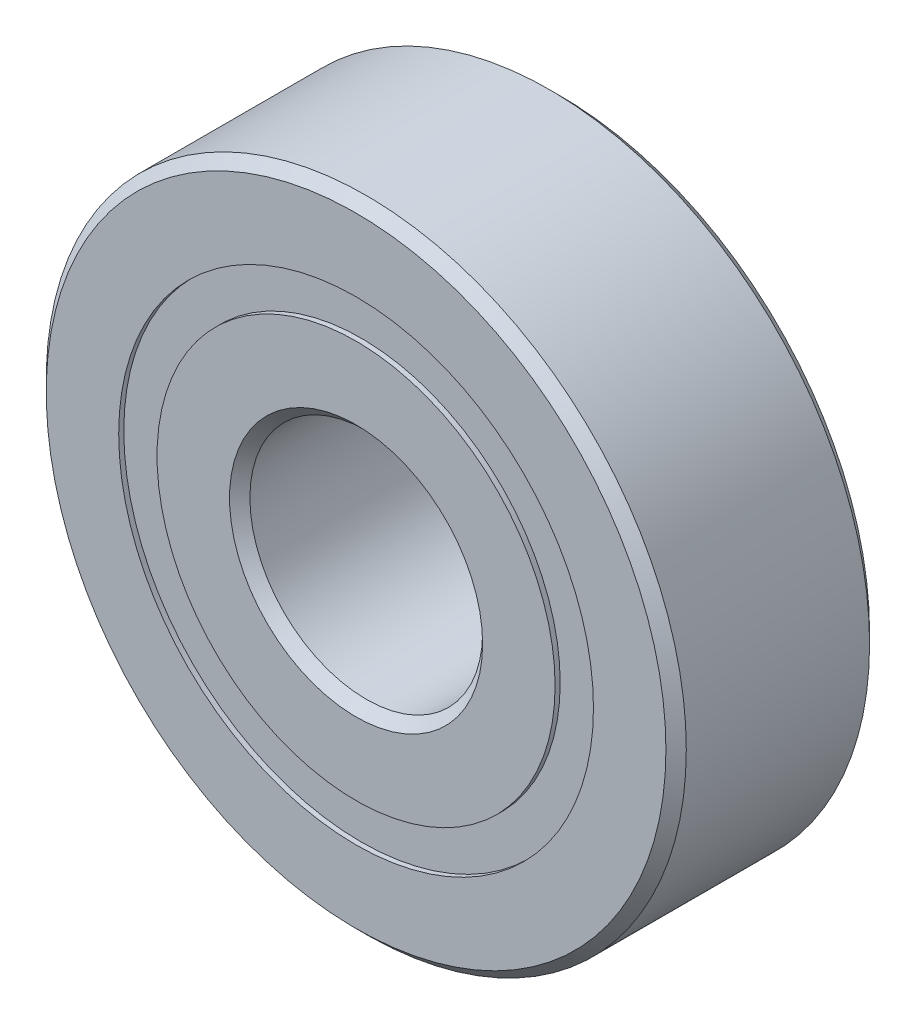
ISO-10303-21;
HEADER;
FILE_DESCRIPTION(('STEP AP214'),'2;1');
FILE_NAME('part.step','',(''),(''),'','','');
FILE_SCHEMA(('AUTOMOTIVE_DESIGN { 1 0 10303 214 1 1 1 1 }'));
ENDSEC;
DATA;
#1=APPLICATION_CONTEXT('core data for automotive mechanical design processes');
#2=APPLICATION_PROTOCOL_DEFINITION('international standard','automotive_design',2000,#1);
#3=PRODUCT_CONTEXT('',#1,'mechanical');
#4=PRODUCT('Part','Part','',(#3));
#5=PRODUCT_RELATED_PRODUCT_CATEGORY('part','',(#4));
#6=PRODUCT_DEFINITION_FORMATION('','',#4);
#7=PRODUCT_DEFINITION_CONTEXT('part definition',#1,'design');
#8=PRODUCT_DEFINITION('design','',#6,#7);
#9=PRODUCT_DEFINITION_SHAPE('','',#8);
#10=(LENGTH_UNIT() NAMED_UNIT(*) SI_UNIT(.MILLI.,.METRE.));
#11=(NAMED_UNIT(*) PLANE_ANGLE_UNIT() SI_UNIT($,.RADIAN.));
#12=(NAMED_UNIT(*) SI_UNIT($,.STERADIAN.) SOLID_ANGLE_UNIT());
#13=UNCERTAINTY_MEASURE_WITH_UNIT(LENGTH_MEASURE(1.E-05),#10,'distance_accuracy_value','');
#14=(GEOMETRIC_REPRESENTATION_CONTEXT(3) GLOBAL_UNCERTAINTY_ASSIGNED_CONTEXT((#13)) GLOBAL_UNIT_ASSIGNED_CONTEXT((#10,
#11,#12)) REPRESENTATION_CONTEXT('',''));
#15=CARTESIAN_POINT('',(0.,0.,0.));
#16=DIRECTION('',(0.,0.,1.));
#17=DIRECTION('',(1.,0.,0.));
#18=AXIS2_PLACEMENT_3D('',#15,#16,#17);
#19=CARTESIAN_POINT('',(-3.74999999999992,6.49519052838334,0.));
#20=DIRECTION('',(0.,0.,1.));
#21=DIRECTION('',(-0.499999999999989,0.866025403784445,0.));
#22=AXIS2_PLACEMENT_3D('',#19,#20,#21);
#23=SPHERICAL_SURFACE('',#22,1.68952158656808);
#24=CARTESIAN_POINT('',(-3.74999999999992,6.49519052838334,1.68952158656808));
#25=VERTEX_POINT('',#24);
#26=VERTEX_LOOP('',#25);
#27=FACE_BOUND('',#26,.T.);
#28=ADVANCED_FACE('F37',(#27),#23,.T.);
#29=CLOSED_SHELL('',(#28));
#30=MANIFOLD_SOLID_BREP('B2',#29);
#31=CARTESIAN_POINT('',(-6.49519052838325,3.75000000000008,0.));
#32=DIRECTION('',(0.,0.,1.));
#33=DIRECTION('',(-0.866025403784433,0.50000000000001,0.));
#34=AXIS2_PLACEMENT_3D('',#31,#32,#33);
#35=SPHERICAL_SURFACE('',#34,1.68952158656808);
#36=CARTESIAN_POINT('',(-6.49519052838325,3.75000000000008,1.68952158656808));
#37=VERTEX_POINT('',#36);
#38=VERTEX_LOOP('',#37);
#39=FACE_BOUND('',#38,.T.);
#40=ADVANCED_FACE('F57',(#39),#35,.T.);
#41=CLOSED_SHELL('',(#40));
#42=MANIFOLD_SOLID_BREP('B6',#41);
#43=CARTESIAN_POINT('',(-7.50000000000001,0.,0.));
#44=DIRECTION('',(0.,0.,1.));
#45=DIRECTION('',(-1.,0.,0.));
#46=AXIS2_PLACEMENT_3D('',#43,#44,#45);
#47=SPHERICAL_SURFACE('',#46,1.68952158656808);
#48=CARTESIAN_POINT('',(-7.50000000000001,0.,1.68952158656808));
#49=VERTEX_POINT('',#48);
#50=VERTEX_LOOP('',#49);
#51=FACE_BOUND('',#50,.T.);
#52=ADVANCED_FACE('F77',(#51),#47,.T.);
#53=CLOSED_SHELL('',(#52));
#54=MANIFOLD_SOLID_BREP('B33',#53);
#55=CARTESIAN_POINT('',(-6.49519052838333,-3.74999999999994,0.));
#56=DIRECTION('',(0.,0.,1.));
#57=DIRECTION('',(-0.866025403784443,-0.499999999999992,0.));
#58=AXIS2_PLACEMENT_3D('',#55,#56,#57);
#59=SPHERICAL_SURFACE('',#58,1.68952158656808);
#60=CARTESIAN_POINT('',(-6.49519052838333,-3.74999999999994,1.68952158656808));
#61=VERTEX_POINT('',#60);
#62=VERTEX_LOOP('',#61);
#63=FACE_BOUND('',#62,.T.);
#64=ADVANCED_FACE('F97',(#63),#59,.T.);
#65=CLOSED_SHELL('',(#64));
#66=MANIFOLD_SOLID_BREP('B53',#65);
#67=CARTESIAN_POINT('',(-3.75000000000006,-6.49519052838327,0.));
#68=DIRECTION('',(0.,0.,1.));
#69=DIRECTION('',(-0.500000000000007,-0.866025403784435,0.));
#70=AXIS2_PLACEMENT_3D('',#67,#68,#69);
#71=SPHERICAL_SURFACE('',#70,1.68952158656808);
#72=CARTESIAN_POINT('',(-3.75000000000006,-6.49519052838327,1.68952158656808));
#73=VERTEX_POINT('',#72);
#74=VERTEX_LOOP('',#73);
#75=FACE_BOUND('',#74,.T.);
#76=ADVANCED_FACE('F117',(#75),#71,.T.);
#77=CLOSED_SHELL('',(#76));
#78=MANIFOLD_SOLID_BREP('B73',#77);
#79=CARTESIAN_POINT('',(0.,-7.50000000000001,0.));
#80=DIRECTION('',(0.,0.,1.));
#81=DIRECTION('',(0.,-1.,0.));
#82=AXIS2_PLACEMENT_3D('',#79,#80,#81);
#83=SPHERICAL_SURFACE('',#82,1.68952158656808);
#84=CARTESIAN_POINT('',(0.,-7.50000000000001,1.68952158656808));
#85=VERTEX_POINT('',#84);
#86=VERTEX_LOOP('',#85);
#87=FACE_BOUND('',#86,.T.);
#88=ADVANCED_FACE('F137',(#87),#83,.T.);
#89=CLOSED_SHELL('',(#88));
#90=MANIFOLD_SOLID_BREP('B93',#89);
#91=CARTESIAN_POINT('',(3.74999999999997,-6.49519052838332,0.));
#92=DIRECTION('',(0.,0.,1.));
#93=DIRECTION('',(0.499999999999995,-0.866025403784442,0.));
#94=AXIS2_PLACEMENT_3D('',#91,#92,#93);
#95=SPHERICAL_SURFACE('',#94,1.68952158656808);
#96=CARTESIAN_POINT('',(3.74999999999997,-6.49519052838332,1.68952158656808));
#97=VERTEX_POINT('',#96);
#98=VERTEX_LOOP('',#97);
#99=FACE_BOUND('',#98,.T.);
#100=ADVANCED_FACE('F157',(#99),#95,.T.);
#101=CLOSED_SHELL('',(#100));
#102=MANIFOLD_SOLID_BREP('B113',#101);
#103=CARTESIAN_POINT('',(6.49519052838328,-3.75000000000003,0.));
#104=DIRECTION('',(0.,0.,1.));
#105=DIRECTION('',(0.866025403784436,-0.500000000000004,0.));
#106=AXIS2_PLACEMENT_3D('',#103,#104,#105);
#107=SPHERICAL_SURFACE('',#106,1.68952158656808);
#108=CARTESIAN_POINT('',(6.49519052838328,-3.75000000000003,1.68952158656808));
#109=VERTEX_POINT('',#108);
#110=VERTEX_LOOP('',#109);
#111=FACE_BOUND('',#110,.T.);
#112=ADVANCED_FACE('F177',(#111),#107,.T.);
#113=CLOSED_SHELL('',(#112));
#114=MANIFOLD_SOLID_BREP('B133',#113);
#115=CARTESIAN_POINT('',(7.50000000000001,0.,0.));
#116=DIRECTION('',(0.,0.,1.));
#117=DIRECTION('',(1.,0.,0.));
#118=AXIS2_PLACEMENT_3D('',#115,#116,#117);
#119=SPHERICAL_SURFACE('',#118,1.68952158656808);
#120=CARTESIAN_POINT('',(7.50000000000001,0.,1.68952158656808));
#121=VERTEX_POINT('',#120);
#122=VERTEX_LOOP('',#121);
#123=FACE_BOUND('',#122,.T.);
#124=ADVANCED_FACE('F197',(#123),#119,.T.);
#125=CLOSED_SHELL('',(#124));
#126=MANIFOLD_SOLID_BREP('B153',#125);
#127=CARTESIAN_POINT('',(6.4951905283833,3.74999999999999,0.));
#128=DIRECTION('',(0.,0.,1.));
#129=DIRECTION('',(0.86602540378444,0.499999999999998,0.));
#130=AXIS2_PLACEMENT_3D('',#127,#128,#129);
#131=SPHERICAL_SURFACE('',#130,1.68952158656808);
#132=CARTESIAN_POINT('',(6.4951905283833,3.74999999999999,1.68952158656808));
#133=VERTEX_POINT('',#132);
#134=VERTEX_LOOP('',#133);
#135=FACE_BOUND('',#134,.T.);
#136=ADVANCED_FACE('F217',(#135),#131,.T.);
#137=CLOSED_SHELL('',(#136));
#138=MANIFOLD_SOLID_BREP('B173',#137);
#139=CARTESIAN_POINT('',(3.75000000000001,6.49519052838329,0.));
#140=DIRECTION('',(0.,0.,1.));
#141=DIRECTION('',(0.500000000000001,0.866025403784438,0.));
#142=AXIS2_PLACEMENT_3D('',#139,#140,#141);
#143=SPHERICAL_SURFACE('',#142,1.68952158656808);
#144=CARTESIAN_POINT('',(3.75000000000001,6.49519052838329,1.68952158656808));
#145=VERTEX_POINT('',#144);
#146=VERTEX_LOOP('',#145);
#147=FACE_BOUND('',#146,.T.);
#148=ADVANCED_FACE('F237',(#147),#143,.T.);
#149=CLOSED_SHELL('',(#148));
#150=MANIFOLD_SOLID_BREP('B193',#149);
#151=CARTESIAN_POINT('',(0.,7.50000000000001,0.));
#152=DIRECTION('',(0.,0.,1.));
#153=DIRECTION('',(0.,1.,0.));
#154=AXIS2_PLACEMENT_3D('',#151,#152,#153);
#155=SPHERICAL_SURFACE('',#154,1.68952158656808);
#156=CARTESIAN_POINT('',(0.,7.50000000000001,1.68952158656808));
#157=VERTEX_POINT('',#156);
#158=VERTEX_LOOP('',#157);
#159=FACE_BOUND('',#158,.T.);
#160=ADVANCED_FACE('F258',(#159),#155,.T.);
#161=CLOSED_SHELL('',(#160));
#162=MANIFOLD_SOLID_BREP('B213',#161);
#163=CARTESIAN_POINT('',(0.,0.,3.5));
#164=DIRECTION('',(0.,0.,1.));
#165=DIRECTION('',(1.,0.,0.));
#166=AXIS2_PLACEMENT_3D('',#163,#164,#165);
#167=CYLINDRICAL_SURFACE('',#166,8.15934065934067);
#168=CARTESIAN_POINT('',(0.,0.,-3.5));
#169=DIRECTION('',(0.,0.,1.));
#170=DIRECTION('',(1.,0.,0.));
#171=AXIS2_PLACEMENT_3D('',#168,#169,#170);
#172=CIRCLE('',#171,8.15934065934067);
#173=CARTESIAN_POINT('',(8.15934065934067,0.,-3.5));
#174=VERTEX_POINT('',#173);
#175=EDGE_CURVE('E310',#174,#174,#172,.T.);
#176=ORIENTED_EDGE('',*,*,#175,.F.);
#177=EDGE_LOOP('',(#176));
#178=FACE_BOUND('',#177,.T.);
#179=CARTESIAN_POINT('',(0.,0.,-3.325));
#180=DIRECTION('',(0.,0.,1.));
#181=DIRECTION('',(1.,0.,0.));
#182=AXIS2_PLACEMENT_3D('',#179,#180,#181);
#183=CIRCLE('',#182,8.15934065934067);
#184=CARTESIAN_POINT('',(8.15934065934067,0.,-3.325));
#185=VERTEX_POINT('',#184);
#186=EDGE_CURVE('E257',#185,#185,#183,.F.);
#187=ORIENTED_EDGE('',*,*,#186,.F.);
#188=EDGE_LOOP('',(#187));
#189=FACE_BOUND('',#188,.T.);
#190=ADVANCED_FACE('F271',(#178,#189),#167,.F.);
#191=CARTESIAN_POINT('',(0.,0.,3.5));
#192=DIRECTION('',(0.,0.,1.));
#193=DIRECTION('',(1.,0.,0.));
#194=AXIS2_PLACEMENT_3D('',#191,#192,#193);
#195=CYLINDRICAL_SURFACE('',#194,6.84065934065935);
#196=CARTESIAN_POINT('',(0.,0.,-3.5));
#197=DIRECTION('',(0.,0.,1.));
#198=DIRECTION('',(1.,0.,0.));
#199=AXIS2_PLACEMENT_3D('',#196,#197,#198);
#200=CIRCLE('',#199,6.84065934065935);
#201=CARTESIAN_POINT('',(6.84065934065935,0.,-3.5));
#202=VERTEX_POINT('',#201);
#203=EDGE_CURVE('E337',#202,#202,#200,.T.);
#204=ORIENTED_EDGE('',*,*,#203,.T.);
#205=EDGE_LOOP('',(#204));
#206=FACE_BOUND('',#205,.T.);
#207=CARTESIAN_POINT('',(0.,0.,-3.325));
#208=DIRECTION('',(0.,0.,1.));
#209=DIRECTION('',(1.,0.,0.));
#210=AXIS2_PLACEMENT_3D('',#207,#208,#209);
#211=CIRCLE('',#210,6.84065934065935);
#212=CARTESIAN_POINT('',(6.84065934065935,0.,-3.325));
#213=VERTEX_POINT('',#212);
#214=EDGE_CURVE('E283',#213,#213,#211,.T.);
#215=ORIENTED_EDGE('',*,*,#214,.F.);
#216=EDGE_LOOP('',(#215));
#217=FACE_BOUND('',#216,.T.);
#218=ADVANCED_FACE('F379',(#206,#217),#195,.T.);
#219=CARTESIAN_POINT('',(0.,0.,3.5));
#220=DIRECTION('',(0.,0.,1.));
#221=DIRECTION('',(1.,0.,0.));
#222=AXIS2_PLACEMENT_3D('',#219,#220,#221);
#223=CYLINDRICAL_SURFACE('',#222,8.15934065934067);
#224=CARTESIAN_POINT('',(0.,0.,3.5));
#225=DIRECTION('',(0.,0.,1.));
#226=DIRECTION('',(1.,0.,0.));
#227=AXIS2_PLACEMENT_3D('',#224,#225,#226);
#228=CIRCLE('',#227,8.15934065934067);
#229=CARTESIAN_POINT('',(8.15934065934067,0.,3.5));
#230=VERTEX_POINT('',#229);
#231=EDGE_CURVE('E301',#230,#230,#228,.T.);
#232=ORIENTED_EDGE('',*,*,#231,.T.);
#233=EDGE_LOOP('',(#232));
#234=FACE_BOUND('',#233,.T.);
#235=CARTESIAN_POINT('',(0.,0.,3.325));
#236=DIRECTION('',(0.,0.,-1.));
#237=DIRECTION('',(-1.,0.,0.));
#238=AXIS2_PLACEMENT_3D('',#235,#236,#237);
#239=CIRCLE('',#238,8.15934065934067);
#240=CARTESIAN_POINT('',(-8.15934065934067,0.,3.325));
#241=VERTEX_POINT('',#240);
#242=EDGE_CURVE('E292',#241,#241,#239,.F.);
#243=ORIENTED_EDGE('',*,*,#242,.F.);
#244=EDGE_LOOP('',(#243));
#245=FACE_BOUND('',#244,.T.);
#246=ADVANCED_FACE('F377',(#234,#245),#223,.F.);
#247=CARTESIAN_POINT('',(0.,0.,3.15));
#248=DIRECTION('',(0.,0.,-1.));
#249=DIRECTION('',(-1.,0.,0.));
#250=AXIS2_PLACEMENT_3D('',#247,#248,#249);
#251=CONICAL_SURFACE('',#250,11.,0.78539816339745);
#252=CARTESIAN_POINT('',(0.,0.,3.5));
#253=DIRECTION('',(0.,0.,1.));
#254=DIRECTION('',(1.,0.,0.));
#255=AXIS2_PLACEMENT_3D('',#252,#253,#254);
#256=CIRCLE('',#255,10.65);
#257=CARTESIAN_POINT('',(10.65,0.,3.5));
#258=VERTEX_POINT('',#257);
#259=EDGE_CURVE('E298',#258,#258,#256,.T.);
#260=ORIENTED_EDGE('',*,*,#259,.F.);
#261=EDGE_LOOP('',(#260));
#262=FACE_BOUND('',#261,.T.);
#263=CARTESIAN_POINT('',(0.,0.,3.15));
#264=DIRECTION('',(0.,0.,1.));
#265=DIRECTION('',(1.,0.,0.));
#266=AXIS2_PLACEMENT_3D('',#263,#264,#265);
#267=CIRCLE('',#266,11.);
#268=CARTESIAN_POINT('',(11.,0.,3.15));
#269=VERTEX_POINT('',#268);
#270=EDGE_CURVE('E319',#269,#269,#267,.T.);
#271=ORIENTED_EDGE('',*,*,#270,.T.);
#272=EDGE_LOOP('',(#271));
#273=FACE_BOUND('',#272,.T.);
#274=ADVANCED_FACE('F273',(#262,#273),#251,.T.);
#275=CARTESIAN_POINT('',(0.,10.65,3.5));
#276=DIRECTION('',(0.,0.,-1.));
#277=DIRECTION('',(-1.,0.,0.));
#278=AXIS2_PLACEMENT_3D('',#275,#276,#277);
#279=PLANE('',#278);
#280=ORIENTED_EDGE('',*,*,#231,.F.);
#281=EDGE_LOOP('',(#280));
#282=FACE_BOUND('',#281,.T.);
#283=ORIENTED_EDGE('',*,*,#259,.T.);
#284=EDGE_LOOP('',(#283));
#285=FACE_BOUND('',#284,.T.);
#286=ADVANCED_FACE('F387',(#282,#285),#279,.F.);
#287=CARTESIAN_POINT('',(0.,10.65,-3.5));
#288=DIRECTION('',(0.,0.,1.));
#289=DIRECTION('',(1.,0.,0.));
#290=AXIS2_PLACEMENT_3D('',#287,#288,#289);
#291=PLANE('',#290);
#292=CARTESIAN_POINT('',(0.,0.,-3.5));
#293=DIRECTION('',(0.,0.,1.));
#294=DIRECTION('',(1.,0.,0.));
#295=AXIS2_PLACEMENT_3D('',#292,#293,#294);
#296=CIRCLE('',#295,10.65);
#297=CARTESIAN_POINT('',(10.65,0.,-3.5));
#298=VERTEX_POINT('',#297);
#299=EDGE_CURVE('E313',#298,#298,#296,.T.);
#300=ORIENTED_EDGE('',*,*,#299,.F.);
#301=EDGE_LOOP('',(#300));
#302=FACE_BOUND('',#301,.T.);
#303=ORIENTED_EDGE('',*,*,#175,.T.);
#304=EDGE_LOOP('',(#303));
#305=FACE_BOUND('',#304,.T.);
#306=ADVANCED_FACE('F449',(#302,#305),#291,.F.);
#307=CARTESIAN_POINT('',(0.,0.,-3.5));
#308=DIRECTION('',(0.,0.,1.));
#309=DIRECTION('',(1.,0.,0.));
#310=AXIS2_PLACEMENT_3D('',#307,#308,#309);
#311=CONICAL_SURFACE('',#310,10.65,0.785398163397459);
#312=CARTESIAN_POINT('',(0.,0.,-3.15));
#313=DIRECTION('',(0.,0.,1.));
#314=DIRECTION('',(1.,0.,0.));
#315=AXIS2_PLACEMENT_3D('',#312,#313,#314);
#316=CIRCLE('',#315,11.);
#317=CARTESIAN_POINT('',(11.,0.,-3.15));
#318=VERTEX_POINT('',#317);
#319=EDGE_CURVE('E316',#318,#318,#316,.T.);
#320=ORIENTED_EDGE('',*,*,#319,.F.);
#321=EDGE_LOOP('',(#320));
#322=FACE_BOUND('',#321,.T.);
#323=ORIENTED_EDGE('',*,*,#299,.T.);
#324=EDGE_LOOP('',(#323));
#325=FACE_BOUND('',#324,.T.);
#326=ADVANCED_FACE('F446',(#322,#325),#311,.T.);
#327=CARTESIAN_POINT('',(0.,0.,3.5));
#328=DIRECTION('',(0.,0.,1.));
#329=DIRECTION('',(1.,0.,0.));
#330=AXIS2_PLACEMENT_3D('',#327,#328,#329);
#331=CYLINDRICAL_SURFACE('',#330,11.);
#332=ORIENTED_EDGE('',*,*,#270,.F.);
#333=EDGE_LOOP('',(#332));
#334=FACE_BOUND('',#333,.T.);
#335=ORIENTED_EDGE('',*,*,#319,.T.);
#336=EDGE_LOOP('',(#335));
#337=FACE_BOUND('',#336,.T.);
#338=ADVANCED_FACE('F373',(#334,#337),#331,.T.);
#339=CARTESIAN_POINT('',(0.,8.15934065934067,3.325));
#340=DIRECTION('',(0.,0.,-1.));
#341=DIRECTION('',(-1.,0.,0.));
#342=AXIS2_PLACEMENT_3D('',#339,#340,#341);
#343=PLANE('',#342);
#344=CARTESIAN_POINT('',(0.,0.,3.325));
#345=DIRECTION('',(0.,0.,1.));
#346=DIRECTION('',(1.,0.,0.));
#347=AXIS2_PLACEMENT_3D('',#344,#345,#346);
#348=CIRCLE('',#347,6.84065934065935);
#349=CARTESIAN_POINT('',(6.84065934065935,0.,3.325));
#350=VERTEX_POINT('',#349);
#351=EDGE_CURVE('E322',#350,#350,#348,.T.);
#352=ORIENTED_EDGE('',*,*,#351,.F.);
#353=EDGE_LOOP('',(#352));
#354=FACE_BOUND('',#353,.T.);
#355=ORIENTED_EDGE('',*,*,#242,.T.);
#356=EDGE_LOOP('',(#355));
#357=FACE_BOUND('',#356,.T.);
#358=ADVANCED_FACE('F366',(#354,#357),#343,.F.);
#359=CARTESIAN_POINT('',(0.,0.,3.5));
#360=DIRECTION('',(0.,0.,1.));
#361=DIRECTION('',(1.,0.,0.));
#362=AXIS2_PLACEMENT_3D('',#359,#360,#361);
#363=CYLINDRICAL_SURFACE('',#362,6.84065934065935);
#364=CARTESIAN_POINT('',(0.,0.,3.5));
#365=DIRECTION('',(0.,0.,1.));
#366=DIRECTION('',(1.,0.,0.));
#367=AXIS2_PLACEMENT_3D('',#364,#365,#366);
#368=CIRCLE('',#367,6.84065934065935);
#369=CARTESIAN_POINT('',(6.84065934065935,0.,3.5));
#370=VERTEX_POINT('',#369);
#371=EDGE_CURVE('E346',#370,#370,#368,.T.);
#372=ORIENTED_EDGE('',*,*,#371,.F.);
#373=EDGE_LOOP('',(#372));
#374=FACE_BOUND('',#373,.T.);
#375=ORIENTED_EDGE('',*,*,#351,.T.);
#376=EDGE_LOOP('',(#375));
#377=FACE_BOUND('',#376,.T.);
#378=ADVANCED_FACE('F363',(#374,#377),#363,.T.);
#379=CARTESIAN_POINT('',(0.,0.,3.5));
#380=DIRECTION('',(0.,0.,1.));
#381=DIRECTION('',(1.,0.,0.));
#382=AXIS2_PLACEMENT_3D('',#379,#380,#381);
#383=CONICAL_SURFACE('',#382,4.35000000000002,0.785398163397462);
#384=CARTESIAN_POINT('',(0.,0.,3.15));
#385=DIRECTION('',(0.,0.,1.));
#386=DIRECTION('',(1.,0.,0.));
#387=AXIS2_PLACEMENT_3D('',#384,#385,#386);
#388=CIRCLE('',#387,4.00000000000001);
#389=CARTESIAN_POINT('',(4.00000000000001,0.,3.15));
#390=VERTEX_POINT('',#389);
#391=EDGE_CURVE('E328',#390,#390,#388,.T.);
#392=ORIENTED_EDGE('',*,*,#391,.F.);
#393=EDGE_LOOP('',(#392));
#394=FACE_BOUND('',#393,.T.);
#395=CARTESIAN_POINT('',(0.,0.,3.5));
#396=DIRECTION('',(0.,0.,1.));
#397=DIRECTION('',(1.,0.,0.));
#398=AXIS2_PLACEMENT_3D('',#395,#396,#397);
#399=CIRCLE('',#398,4.35000000000002);
#400=CARTESIAN_POINT('',(4.35000000000002,0.,3.5));
#401=VERTEX_POINT('',#400);
#402=EDGE_CURVE('E349',#401,#401,#399,.T.);
#403=ORIENTED_EDGE('',*,*,#402,.T.);
#404=EDGE_LOOP('',(#403));
#405=FACE_BOUND('',#404,.T.);
#406=ADVANCED_FACE('F353',(#394,#405),#383,.F.);
#407=CARTESIAN_POINT('',(0.,0.,3.5));
#408=DIRECTION('',(0.,0.,1.));
#409=DIRECTION('',(1.,0.,0.));
#410=AXIS2_PLACEMENT_3D('',#407,#408,#409);
#411=CYLINDRICAL_SURFACE('',#410,4.00000000000001);
#412=CARTESIAN_POINT('',(0.,0.,-3.15));
#413=DIRECTION('',(0.,0.,1.));
#414=DIRECTION('',(1.,0.,0.));
#415=AXIS2_PLACEMENT_3D('',#412,#413,#414);
#416=CIRCLE('',#415,4.00000000000001);
#417=CARTESIAN_POINT('',(4.00000000000001,0.,-3.15));
#418=VERTEX_POINT('',#417);
#419=EDGE_CURVE('E331',#418,#418,#416,.T.);
#420=ORIENTED_EDGE('',*,*,#419,.F.);
#421=EDGE_LOOP('',(#420));
#422=FACE_BOUND('',#421,.T.);
#423=ORIENTED_EDGE('',*,*,#391,.T.);
#424=EDGE_LOOP('',(#423));
#425=FACE_BOUND('',#424,.T.);
#426=ADVANCED_FACE('F436',(#422,#425),#411,.F.);
#427=CARTESIAN_POINT('',(0.,0.,-3.15));
#428=DIRECTION('',(0.,0.,-1.));
#429=DIRECTION('',(-1.,0.,0.));
#430=AXIS2_PLACEMENT_3D('',#427,#428,#429);
#431=CONICAL_SURFACE('',#430,4.00000000000001,0.785398163397462);
#432=CARTESIAN_POINT('',(0.,0.,-3.5));
#433=DIRECTION('',(0.,0.,1.));
#434=DIRECTION('',(1.,0.,0.));
#435=AXIS2_PLACEMENT_3D('',#432,#433,#434);
#436=CIRCLE('',#435,4.35000000000002);
#437=CARTESIAN_POINT('',(4.35000000000002,0.,-3.5));
#438=VERTEX_POINT('',#437);
#439=EDGE_CURVE('E334',#438,#438,#436,.T.);
#440=ORIENTED_EDGE('',*,*,#439,.F.);
#441=EDGE_LOOP('',(#440));
#442=FACE_BOUND('',#441,.T.);
#443=ORIENTED_EDGE('',*,*,#419,.T.);
#444=EDGE_LOOP('',(#443));
#445=FACE_BOUND('',#444,.T.);
#446=ADVANCED_FACE('F432',(#442,#445),#431,.F.);
#447=CARTESIAN_POINT('',(0.,4.35000000000002,-3.5));
#448=DIRECTION('',(0.,0.,1.));
#449=DIRECTION('',(1.,0.,0.));
#450=AXIS2_PLACEMENT_3D('',#447,#448,#449);
#451=PLANE('',#450);
#452=ORIENTED_EDGE('',*,*,#203,.F.);
#453=EDGE_LOOP('',(#452));
#454=FACE_BOUND('',#453,.T.);
#455=ORIENTED_EDGE('',*,*,#439,.T.);
#456=EDGE_LOOP('',(#455));
#457=FACE_BOUND('',#456,.T.);
#458=ADVANCED_FACE('F359',(#454,#457),#451,.F.);
#459=CARTESIAN_POINT('',(0.,4.35000000000002,3.5));
#460=DIRECTION('',(0.,0.,-1.));
#461=DIRECTION('',(-1.,0.,0.));
#462=AXIS2_PLACEMENT_3D('',#459,#460,#461);
#463=PLANE('',#462);
#464=ORIENTED_EDGE('',*,*,#402,.F.);
#465=EDGE_LOOP('',(#464));
#466=FACE_BOUND('',#465,.T.);
#467=ORIENTED_EDGE('',*,*,#371,.T.);
#468=EDGE_LOOP('',(#467));
#469=FACE_BOUND('',#468,.T.);
#470=ADVANCED_FACE('F355',(#466,#469),#463,.F.);
#471=CARTESIAN_POINT('',(0.,8.15934065934067,-3.325));
#472=DIRECTION('',(0.,0.,1.));
#473=DIRECTION('',(1.,0.,0.));
#474=AXIS2_PLACEMENT_3D('',#471,#472,#473);
#475=PLANE('',#474);
#476=ORIENTED_EDGE('',*,*,#186,.T.);
#477=EDGE_LOOP('',(#476));
#478=FACE_BOUND('',#477,.T.);
#479=ORIENTED_EDGE('',*,*,#214,.T.);
#480=EDGE_LOOP('',(#479));
#481=FACE_BOUND('',#480,.T.);
#482=ADVANCED_FACE('F358',(#478,#481),#475,.F.);
#483=CLOSED_SHELL('',(#190,#218,#246,#274,#286,#306,#326,#338,#358,#378,#406,#426,#446,#458,
#470,#482));
#484=CARTESIAN_POINT('',(0.,8.15934065934067,-1.68952158656808));
#485=DIRECTION('',(0.,0.,-1.));
#486=DIRECTION('',(-1.,0.,0.));
#487=AXIS2_PLACEMENT_3D('',#484,#485,#486);
#488=PLANE('',#487);
#489=CARTESIAN_POINT('',(0.,0.,-1.68952158656808));
#490=DIRECTION('',(0.,0.,-1.));
#491=DIRECTION('',(-1.,0.,0.));
#492=AXIS2_PLACEMENT_3D('',#489,#490,#491);
#493=CIRCLE('',#492,6.84065934065935);
#494=CARTESIAN_POINT('',(-6.84065934065935,0.,-1.68952158656808));
#495=VERTEX_POINT('',#494);
#496=EDGE_CURVE('E287',#495,#495,#493,.T.);
#497=ORIENTED_EDGE('',*,*,#496,.T.);
#498=EDGE_LOOP('',(#497));
#499=FACE_BOUND('',#498,.T.);
#500=CARTESIAN_POINT('',(0.,0.,-1.68952158656808));
#501=DIRECTION('',(0.,0.,-1.));
#502=DIRECTION('',(-1.,0.,0.));
#503=AXIS2_PLACEMENT_3D('',#500,#501,#502);
#504=CIRCLE('',#503,8.15934065934067);
#505=CARTESIAN_POINT('',(-8.15934065934067,0.,-1.68952158656808));
#506=VERTEX_POINT('',#505);
#507=EDGE_CURVE('E279',#506,#506,#504,.F.);
#508=ORIENTED_EDGE('',*,*,#507,.T.);
#509=EDGE_LOOP('',(#508));
#510=FACE_BOUND('',#509,.T.);
#511=ADVANCED_FACE('F395',(#499,#510),#488,.F.);
#512=CARTESIAN_POINT('',(0.,0.,1.55555555555556));
#513=DIRECTION('',(0.,0.,1.));
#514=DIRECTION('',(1.,0.,0.));
#515=AXIS2_PLACEMENT_3D('',#512,#513,#514);
#516=CIRCLE('',#515,8.15934065934067);
#517=CARTESIAN_POINT('',(8.15934065934067,0.,1.55555555555556));
#518=VERTEX_POINT('',#517);
#519=EDGE_CURVE('E304',#518,#518,#516,.T.);
#520=ORIENTED_EDGE('',*,*,#519,.F.);
#521=EDGE_LOOP('',(#520));
#522=FACE_BOUND('',#521,.T.);
#523=CARTESIAN_POINT('',(0.,0.,1.68952158656808));
#524=DIRECTION('',(0.,0.,1.));
#525=DIRECTION('',(1.,0.,0.));
#526=AXIS2_PLACEMENT_3D('',#523,#524,#525);
#527=CIRCLE('',#526,8.15934065934067);
#528=CARTESIAN_POINT('',(8.15934065934067,0.,1.68952158656808));
#529=VERTEX_POINT('',#528);
#530=EDGE_CURVE('E295',#529,#529,#527,.F.);
#531=ORIENTED_EDGE('',*,*,#530,.F.);
#532=EDGE_LOOP('',(#531));
#533=FACE_BOUND('',#532,.T.);
#534=ADVANCED_FACE('F382',(#522,#533),#223,.F.);
#535=CARTESIAN_POINT('',(0.,0.,0.));
#536=DIRECTION('',(0.,0.,1.));
#537=DIRECTION('',(1.,0.,0.));
#538=AXIS2_PLACEMENT_3D('',#535,#536,#537);
#539=TOROIDAL_SURFACE('',#538,7.50000000000001,1.68952158656808);
#540=CARTESIAN_POINT('',(0.,0.,-1.55555555555556));
#541=DIRECTION('',(0.,0.,1.));
#542=DIRECTION('',(1.,0.,0.));
#543=AXIS2_PLACEMENT_3D('',#540,#541,#542);
#544=CIRCLE('',#543,8.15934065934067);
#545=CARTESIAN_POINT('',(8.15934065934067,0.,-1.55555555555556));
#546=VERTEX_POINT('',#545);
#547=EDGE_CURVE('E307',#546,#546,#544,.T.);
#548=ORIENTED_EDGE('',*,*,#547,.F.);
#549=EDGE_LOOP('',(#548));
#550=FACE_BOUND('',#549,.T.);
#551=ORIENTED_EDGE('',*,*,#519,.T.);
#552=EDGE_LOOP('',(#551));
#553=FACE_BOUND('',#552,.T.);
#554=ADVANCED_FACE('F394',(#550,#553),#539,.F.);
#555=ORIENTED_EDGE('',*,*,#547,.T.);
#556=EDGE_LOOP('',(#555));
#557=FACE_BOUND('',#556,.T.);
#558=ORIENTED_EDGE('',*,*,#507,.F.);
#559=EDGE_LOOP('',(#558));
#560=FACE_BOUND('',#559,.T.);
#561=ADVANCED_FACE('F401',(#557,#560),#167,.F.);
#562=CARTESIAN_POINT('',(0.,8.15934065934067,1.68952158656808));
#563=DIRECTION('',(0.,0.,1.));
#564=DIRECTION('',(1.,0.,0.));
#565=AXIS2_PLACEMENT_3D('',#562,#563,#564);
#566=PLANE('',#565);
#567=ORIENTED_EDGE('',*,*,#530,.T.);
#568=EDGE_LOOP('',(#567));
#569=FACE_BOUND('',#568,.T.);
#570=CARTESIAN_POINT('',(0.,0.,1.68952158656808));
#571=DIRECTION('',(0.,0.,1.));
#572=DIRECTION('',(1.,0.,0.));
#573=AXIS2_PLACEMENT_3D('',#570,#571,#572);
#574=CIRCLE('',#573,6.84065934065935);
#575=CARTESIAN_POINT('',(6.84065934065935,0.,1.68952158656808));
#576=VERTEX_POINT('',#575);
#577=EDGE_CURVE('E325',#576,#576,#574,.F.);
#578=ORIENTED_EDGE('',*,*,#577,.F.);
#579=EDGE_LOOP('',(#578));
#580=FACE_BOUND('',#579,.T.);
#581=ADVANCED_FACE('F408',(#569,#580),#566,.F.);
#582=CARTESIAN_POINT('',(0.,0.,1.55555555555556));
#583=DIRECTION('',(0.,0.,1.));
#584=DIRECTION('',(1.,0.,0.));
#585=AXIS2_PLACEMENT_3D('',#582,#583,#584);
#586=CIRCLE('',#585,6.84065934065935);
#587=CARTESIAN_POINT('',(6.84065934065935,0.,1.55555555555556));
#588=VERTEX_POINT('',#587);
#589=EDGE_CURVE('E343',#588,#588,#586,.T.);
#590=ORIENTED_EDGE('',*,*,#589,.T.);
#591=EDGE_LOOP('',(#590));
#592=FACE_BOUND('',#591,.T.);
#593=ORIENTED_EDGE('',*,*,#577,.T.);
#594=EDGE_LOOP('',(#593));
#595=FACE_BOUND('',#594,.T.);
#596=ADVANCED_FACE('F368',(#592,#595),#363,.T.);
#597=CARTESIAN_POINT('',(0.,0.,0.));
#598=DIRECTION('',(0.,0.,1.));
#599=DIRECTION('',(1.,0.,0.));
#600=AXIS2_PLACEMENT_3D('',#597,#598,#599);
#601=TOROIDAL_SURFACE('',#600,7.50000000000001,1.68952158656808);
#602=ORIENTED_EDGE('',*,*,#589,.F.);
#603=EDGE_LOOP('',(#602));
#604=FACE_BOUND('',#603,.T.);
#605=CARTESIAN_POINT('',(0.,0.,-1.55555555555556));
#606=DIRECTION('',(0.,0.,1.));
#607=DIRECTION('',(1.,0.,0.));
#608=AXIS2_PLACEMENT_3D('',#605,#606,#607);
#609=CIRCLE('',#608,6.84065934065935);
#610=CARTESIAN_POINT('',(6.84065934065935,0.,-1.55555555555556));
#611=VERTEX_POINT('',#610);
#612=EDGE_CURVE('E340',#611,#611,#609,.T.);
#613=ORIENTED_EDGE('',*,*,#612,.T.);
#614=EDGE_LOOP('',(#613));
#615=FACE_BOUND('',#614,.T.);
#616=ADVANCED_FACE('F426',(#604,#615),#601,.F.);
#617=ORIENTED_EDGE('',*,*,#612,.F.);
#618=EDGE_LOOP('',(#617));
#619=FACE_BOUND('',#618,.T.);
#620=ORIENTED_EDGE('',*,*,#496,.F.);
#621=EDGE_LOOP('',(#620));
#622=FACE_BOUND('',#621,.T.);
#623=ADVANCED_FACE('F391',(#619,#622),#195,.T.);
#624=CLOSED_SHELL('',(#511,#534,#554,#561,#581,#596,#616,#623));
#625=ORIENTED_CLOSED_SHELL('',*,#624,.T.);
#626=BREP_WITH_VOIDS('B233',#483,(#625));
#627=ADVANCED_BREP_SHAPE_REPRESENTATION('',(#18,#30,#42,#54,#66,#78,#90,#102,#114,#126,#138,
#150,#162,#626),#14);
#628=SHAPE_DEFINITION_REPRESENTATION(#9,#627);
ENDSEC;
END-ISO-10303-21;
